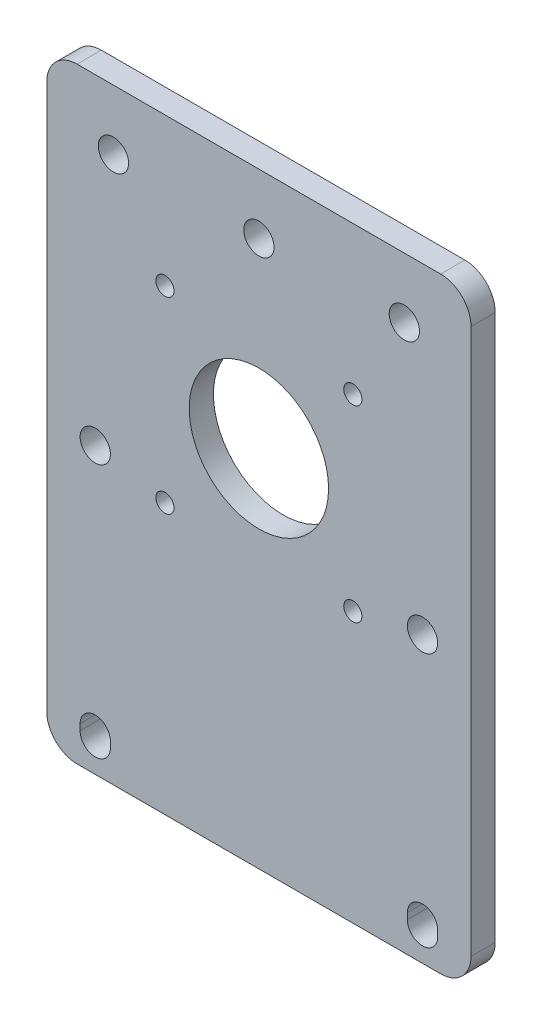
ISO-10303-21;
HEADER;
FILE_DESCRIPTION(('STEP AP214'),'2;1');
FILE_NAME('part.step','',(''),(''),'','','');
FILE_SCHEMA(('AUTOMOTIVE_DESIGN { 1 0 10303 214 1 1 1 1 }'));
ENDSEC;
DATA;
#1=APPLICATION_CONTEXT('core data for automotive mechanical design processes');
#2=APPLICATION_PROTOCOL_DEFINITION('international standard','automotive_design',2000,#1);
#3=PRODUCT_CONTEXT('',#1,'mechanical');
#4=PRODUCT('Part','Part','',(#3));
#5=PRODUCT_RELATED_PRODUCT_CATEGORY('part','',(#4));
#6=PRODUCT_DEFINITION_FORMATION('','',#4);
#7=PRODUCT_DEFINITION_CONTEXT('part definition',#1,'design');
#8=PRODUCT_DEFINITION('design','',#6,#7);
#9=PRODUCT_DEFINITION_SHAPE('','',#8);
#10=(LENGTH_UNIT() NAMED_UNIT(*) SI_UNIT(.MILLI.,.METRE.));
#11=(NAMED_UNIT(*) PLANE_ANGLE_UNIT() SI_UNIT($,.RADIAN.));
#12=(NAMED_UNIT(*) SI_UNIT($,.STERADIAN.) SOLID_ANGLE_UNIT());
#13=UNCERTAINTY_MEASURE_WITH_UNIT(LENGTH_MEASURE(1.E-05),#10,'distance_accuracy_value','');
#14=(GEOMETRIC_REPRESENTATION_CONTEXT(3) GLOBAL_UNCERTAINTY_ASSIGNED_CONTEXT((#13)) GLOBAL_UNIT_ASSIGNED_CONTEXT((#10,
#11,#12)) REPRESENTATION_CONTEXT('',''));
#15=CARTESIAN_POINT('',(0.,0.,0.));
#16=DIRECTION('',(0.,0.,1.));
#17=DIRECTION('',(1.,0.,0.));
#18=AXIS2_PLACEMENT_3D('',#15,#16,#17);
#19=CARTESIAN_POINT('',(0.,0.,4.));
#20=DIRECTION('',(0.,0.,1.));
#21=DIRECTION('',(1.,0.,0.));
#22=AXIS2_PLACEMENT_3D('',#19,#20,#21);
#23=PLANE('',#22);
#24=CARTESIAN_POINT('',(24.,40.076696830622,4.));
#25=DIRECTION('',(0.,0.,1.));
#26=DIRECTION('',(1.,0.,0.));
#27=AXIS2_PLACEMENT_3D('',#24,#25,#26);
#28=CIRCLE('',#27,2.5);
#29=CARTESIAN_POINT('',(26.5,40.076696830622,4.));
#30=VERTEX_POINT('',#29);
#31=EDGE_CURVE('E599',#30,#30,#28,.T.);
#32=ORIENTED_EDGE('',*,*,#31,.F.);
#33=EDGE_LOOP('',(#32));
#34=FACE_BOUND('',#33,.T.);
#35=CARTESIAN_POINT('',(-24.,40.076696830622,4.));
#36=DIRECTION('',(0.,0.,1.));
#37=DIRECTION('',(-1.,0.,0.));
#38=AXIS2_PLACEMENT_3D('',#35,#36,#37);
#39=CIRCLE('',#38,2.5);
#40=CARTESIAN_POINT('',(-26.5,40.076696830622,4.));
#41=VERTEX_POINT('',#40);
#42=EDGE_CURVE('E609',#41,#41,#39,.T.);
#43=ORIENTED_EDGE('',*,*,#42,.F.);
#44=EDGE_LOOP('',(#43));
#45=FACE_BOUND('',#44,.T.);
#46=CARTESIAN_POINT('',(0.,40.076696830622,4.));
#47=DIRECTION('',(0.,0.,1.));
#48=DIRECTION('',(1.,0.,0.));
#49=AXIS2_PLACEMENT_3D('',#46,#47,#48);
#50=CIRCLE('',#49,2.5);
#51=CARTESIAN_POINT('',(2.5,40.076696830622,4.));
#52=VERTEX_POINT('',#51);
#53=EDGE_CURVE('E616',#52,#52,#50,.T.);
#54=ORIENTED_EDGE('',*,*,#53,.F.);
#55=EDGE_LOOP('',(#54));
#56=FACE_BOUND('',#55,.T.);
#57=CARTESIAN_POINT('',(-15.5,-5.42330316937797,4.));
#58=DIRECTION('',(0.,0.,1.));
#59=DIRECTION('',(-1.,0.,0.));
#60=AXIS2_PLACEMENT_3D('',#57,#58,#59);
#61=CIRCLE('',#60,1.5);
#62=CARTESIAN_POINT('',(-17.,-5.42330316937797,4.));
#63=VERTEX_POINT('',#62);
#64=EDGE_CURVE('E622',#63,#63,#61,.T.);
#65=ORIENTED_EDGE('',*,*,#64,.F.);
#66=EDGE_LOOP('',(#65));
#67=FACE_BOUND('',#66,.T.);
#68=CARTESIAN_POINT('',(15.5,-5.42330316937798,4.));
#69=DIRECTION('',(0.,0.,1.));
#70=DIRECTION('',(1.,0.,0.));
#71=AXIS2_PLACEMENT_3D('',#68,#69,#70);
#72=CIRCLE('',#71,1.5);
#73=CARTESIAN_POINT('',(17.,-5.42330316937798,4.));
#74=VERTEX_POINT('',#73);
#75=EDGE_CURVE('E629',#74,#74,#72,.T.);
#76=ORIENTED_EDGE('',*,*,#75,.F.);
#77=EDGE_LOOP('',(#76));
#78=FACE_BOUND('',#77,.T.);
#79=CARTESIAN_POINT('',(15.5,25.576696830622,4.));
#80=DIRECTION('',(0.,0.,1.));
#81=DIRECTION('',(-1.,0.,0.));
#82=AXIS2_PLACEMENT_3D('',#79,#80,#81);
#83=CIRCLE('',#82,1.5);
#84=CARTESIAN_POINT('',(14.,25.576696830622,4.));
#85=VERTEX_POINT('',#84);
#86=EDGE_CURVE('E636',#85,#85,#83,.T.);
#87=ORIENTED_EDGE('',*,*,#86,.F.);
#88=EDGE_LOOP('',(#87));
#89=FACE_BOUND('',#88,.T.);
#90=CARTESIAN_POINT('',(-15.5,25.576696830622,4.));
#91=DIRECTION('',(0.,0.,1.));
#92=DIRECTION('',(1.,0.,0.));
#93=AXIS2_PLACEMENT_3D('',#90,#91,#92);
#94=CIRCLE('',#93,1.5);
#95=CARTESIAN_POINT('',(-14.,25.576696830622,4.));
#96=VERTEX_POINT('',#95);
#97=EDGE_CURVE('E643',#96,#96,#94,.T.);
#98=ORIENTED_EDGE('',*,*,#97,.F.);
#99=EDGE_LOOP('',(#98));
#100=FACE_BOUND('',#99,.T.);
#101=CARTESIAN_POINT('',(0.,10.076696830622,4.));
#102=DIRECTION('',(0.,0.,1.));
#103=DIRECTION('',(1.,0.,0.));
#104=AXIS2_PLACEMENT_3D('',#101,#102,#103);
#105=CIRCLE('',#104,11.5);
#106=CARTESIAN_POINT('',(11.5,10.076696830622,4.));
#107=VERTEX_POINT('',#106);
#108=EDGE_CURVE('E249',#107,#107,#105,.T.);
#109=ORIENTED_EDGE('',*,*,#108,.F.);
#110=EDGE_LOOP('',(#109));
#111=FACE_BOUND('',#110,.T.);
#112=DIRECTION('',(0.,-1.,0.));
#113=VECTOR('',#112,1.);
#114=CARTESIAN_POINT('',(24.5,-44.,4.));
#115=LINE('',#114,#113);
#116=CARTESIAN_POINT('',(24.5,-44.,4.));
#117=VERTEX_POINT('',#116);
#118=CARTESIAN_POINT('',(24.5,-45.,4.));
#119=VERTEX_POINT('',#118);
#120=EDGE_CURVE('E172',#117,#119,#115,.T.);
#121=ORIENTED_EDGE('',*,*,#120,.F.);
#122=CARTESIAN_POINT('',(27.,-44.,4.));
#123=DIRECTION('',(0.,0.,1.));
#124=DIRECTION('',(-1.,0.,0.));
#125=AXIS2_PLACEMENT_3D('',#122,#123,#124);
#126=CIRCLE('',#125,2.5);
#127=CARTESIAN_POINT('',(29.5,-44.,4.));
#128=VERTEX_POINT('',#127);
#129=EDGE_CURVE('E162',#128,#117,#126,.T.);
#130=ORIENTED_EDGE('',*,*,#129,.F.);
#131=DIRECTION('',(0.,1.,0.));
#132=VECTOR('',#131,1.);
#133=CARTESIAN_POINT('',(29.5,-44.,4.));
#134=LINE('',#133,#132);
#135=CARTESIAN_POINT('',(29.5,-45.,4.));
#136=VERTEX_POINT('',#135);
#137=EDGE_CURVE('E189',#136,#128,#134,.T.);
#138=ORIENTED_EDGE('',*,*,#137,.F.);
#139=CARTESIAN_POINT('',(27.,-45.,4.));
#140=DIRECTION('',(0.,0.,1.));
#141=DIRECTION('',(-1.,0.,0.));
#142=AXIS2_PLACEMENT_3D('',#139,#140,#141);
#143=CIRCLE('',#142,2.5);
#144=EDGE_CURVE('E186',#119,#136,#143,.T.);
#145=ORIENTED_EDGE('',*,*,#144,.F.);
#146=EDGE_LOOP('',(#121,#130,#138,#145));
#147=FACE_BOUND('',#146,.T.);
#148=DIRECTION('',(0.,-1.,0.));
#149=VECTOR('',#148,1.);
#150=CARTESIAN_POINT('',(-29.5,-44.,4.));
#151=LINE('',#150,#149);
#152=CARTESIAN_POINT('',(-29.5,-44.,4.));
#153=VERTEX_POINT('',#152);
#154=CARTESIAN_POINT('',(-29.5,-45.,4.));
#155=VERTEX_POINT('',#154);
#156=EDGE_CURVE('E217',#153,#155,#151,.T.);
#157=ORIENTED_EDGE('',*,*,#156,.F.);
#158=CARTESIAN_POINT('',(-27.,-44.,4.));
#159=DIRECTION('',(0.,0.,1.));
#160=DIRECTION('',(1.,0.,0.));
#161=AXIS2_PLACEMENT_3D('',#158,#159,#160);
#162=CIRCLE('',#161,2.5);
#163=CARTESIAN_POINT('',(-24.5,-44.,4.));
#164=VERTEX_POINT('',#163);
#165=EDGE_CURVE('E795',#164,#153,#162,.T.);
#166=ORIENTED_EDGE('',*,*,#165,.F.);
#167=DIRECTION('',(0.,1.,0.));
#168=VECTOR('',#167,1.);
#169=CARTESIAN_POINT('',(-24.5,-44.,4.));
#170=LINE('',#169,#168);
#171=CARTESIAN_POINT('',(-24.5,-45.,4.));
#172=VERTEX_POINT('',#171);
#173=EDGE_CURVE('E216',#172,#164,#170,.T.);
#174=ORIENTED_EDGE('',*,*,#173,.F.);
#175=CARTESIAN_POINT('',(-27.,-45.,4.));
#176=DIRECTION('',(0.,0.,1.));
#177=DIRECTION('',(1.,0.,0.));
#178=AXIS2_PLACEMENT_3D('',#175,#176,#177);
#179=CIRCLE('',#178,2.5);
#180=EDGE_CURVE('E210',#155,#172,#179,.T.);
#181=ORIENTED_EDGE('',*,*,#180,.F.);
#182=EDGE_LOOP('',(#157,#166,#174,#181));
#183=FACE_BOUND('',#182,.T.);
#184=CARTESIAN_POINT('',(-27.,-3.,4.));
#185=DIRECTION('',(0.,0.,1.));
#186=DIRECTION('',(1.,0.,0.));
#187=AXIS2_PLACEMENT_3D('',#184,#185,#186);
#188=CIRCLE('',#187,2.5);
#189=CARTESIAN_POINT('',(-24.5,-3.,4.));
#190=VERTEX_POINT('',#189);
#191=EDGE_CURVE('E227',#190,#190,#188,.T.);
#192=ORIENTED_EDGE('',*,*,#191,.F.);
#193=EDGE_LOOP('',(#192));
#194=FACE_BOUND('',#193,.T.);
#195=DIRECTION('',(0.,-1.,0.));
#196=VECTOR('',#195,1.);
#197=CARTESIAN_POINT('',(-35.,50.,4.));
#198=LINE('',#197,#196);
#199=CARTESIAN_POINT('',(-35.,45.,4.));
#200=VERTEX_POINT('',#199);
#201=CARTESIAN_POINT('',(-35.,-45.,4.));
#202=VERTEX_POINT('',#201);
#203=EDGE_CURVE('E257',#200,#202,#198,.T.);
#204=ORIENTED_EDGE('',*,*,#203,.T.);
#205=CARTESIAN_POINT('',(-30.,-45.,4.));
#206=DIRECTION('',(0.,0.,1.));
#207=DIRECTION('',(1.,0.,0.));
#208=AXIS2_PLACEMENT_3D('',#205,#206,#207);
#209=CIRCLE('',#208,5.);
#210=CARTESIAN_POINT('',(-30.,-50.,4.));
#211=VERTEX_POINT('',#210);
#212=EDGE_CURVE('E303',#202,#211,#209,.T.);
#213=ORIENTED_EDGE('',*,*,#212,.T.);
#214=DIRECTION('',(1.,0.,0.));
#215=VECTOR('',#214,1.);
#216=CARTESIAN_POINT('',(-35.,-50.,4.));
#217=LINE('',#216,#215);
#218=CARTESIAN_POINT('',(30.,-50.,4.));
#219=VERTEX_POINT('',#218);
#220=EDGE_CURVE('E263',#211,#219,#217,.T.);
#221=ORIENTED_EDGE('',*,*,#220,.T.);
#222=CARTESIAN_POINT('',(30.,-45.,4.));
#223=DIRECTION('',(0.,0.,1.));
#224=DIRECTION('',(1.,0.,0.));
#225=AXIS2_PLACEMENT_3D('',#222,#223,#224);
#226=CIRCLE('',#225,5.);
#227=CARTESIAN_POINT('',(35.,-45.,4.));
#228=VERTEX_POINT('',#227);
#229=EDGE_CURVE('E301',#219,#228,#226,.T.);
#230=ORIENTED_EDGE('',*,*,#229,.T.);
#231=DIRECTION('',(0.,1.,0.));
#232=VECTOR('',#231,1.);
#233=CARTESIAN_POINT('',(35.,50.,4.));
#234=LINE('',#233,#232);
#235=CARTESIAN_POINT('',(35.,45.,4.));
#236=VERTEX_POINT('',#235);
#237=EDGE_CURVE('E280',#228,#236,#234,.T.);
#238=ORIENTED_EDGE('',*,*,#237,.T.);
#239=CARTESIAN_POINT('',(30.,45.,4.));
#240=DIRECTION('',(0.,0.,1.));
#241=DIRECTION('',(1.,0.,0.));
#242=AXIS2_PLACEMENT_3D('',#239,#240,#241);
#243=CIRCLE('',#242,5.);
#244=CARTESIAN_POINT('',(30.,50.,4.));
#245=VERTEX_POINT('',#244);
#246=EDGE_CURVE('E68',#236,#245,#243,.T.);
#247=ORIENTED_EDGE('',*,*,#246,.T.);
#248=DIRECTION('',(-1.,0.,0.));
#249=VECTOR('',#248,1.);
#250=CARTESIAN_POINT('',(-35.,50.,4.));
#251=LINE('',#250,#249);
#252=CARTESIAN_POINT('',(-30.,50.,4.));
#253=VERTEX_POINT('',#252);
#254=EDGE_CURVE('E264',#245,#253,#251,.T.);
#255=ORIENTED_EDGE('',*,*,#254,.T.);
#256=CARTESIAN_POINT('',(-30.,45.,4.));
#257=DIRECTION('',(0.,0.,1.));
#258=DIRECTION('',(1.,0.,0.));
#259=AXIS2_PLACEMENT_3D('',#256,#257,#258);
#260=CIRCLE('',#259,5.);
#261=EDGE_CURVE('E298',#253,#200,#260,.T.);
#262=ORIENTED_EDGE('',*,*,#261,.T.);
#263=EDGE_LOOP('',(#204,#213,#221,#230,#238,#247,#255,#262));
#264=FACE_BOUND('',#263,.T.);
#265=CARTESIAN_POINT('',(27.,-3.,4.));
#266=DIRECTION('',(0.,0.,1.));
#267=DIRECTION('',(-1.,0.,0.));
#268=AXIS2_PLACEMENT_3D('',#265,#266,#267);
#269=CIRCLE('',#268,2.5);
#270=CARTESIAN_POINT('',(24.5,-3.,4.));
#271=VERTEX_POINT('',#270);
#272=EDGE_CURVE('E243',#271,#271,#269,.T.);
#273=ORIENTED_EDGE('',*,*,#272,.F.);
#274=EDGE_LOOP('',(#273));
#275=FACE_BOUND('',#274,.T.);
#276=ADVANCED_FACE('F47',(#34,#45,#56,#67,#78,#89,#100,#111,#147,#183,#194,#264,#275),#23,.T.);
#277=CARTESIAN_POINT('',(0.,0.,0.));
#278=DIRECTION('',(0.,0.,1.));
#279=DIRECTION('',(1.,0.,0.));
#280=AXIS2_PLACEMENT_3D('',#277,#278,#279);
#281=PLANE('',#280);
#282=CARTESIAN_POINT('',(24.,40.076696830622,0.));
#283=DIRECTION('',(0.,0.,1.));
#284=DIRECTION('',(1.,0.,0.));
#285=AXIS2_PLACEMENT_3D('',#282,#283,#284);
#286=CIRCLE('',#285,2.5);
#287=CARTESIAN_POINT('',(26.5,40.076696830622,0.));
#288=VERTEX_POINT('',#287);
#289=EDGE_CURVE('E604',#288,#288,#286,.T.);
#290=ORIENTED_EDGE('',*,*,#289,.T.);
#291=EDGE_LOOP('',(#290));
#292=FACE_BOUND('',#291,.T.);
#293=CARTESIAN_POINT('',(-24.,40.076696830622,0.));
#294=DIRECTION('',(0.,0.,1.));
#295=DIRECTION('',(-1.,0.,0.));
#296=AXIS2_PLACEMENT_3D('',#293,#294,#295);
#297=CIRCLE('',#296,2.5);
#298=CARTESIAN_POINT('',(-26.5,40.076696830622,0.));
#299=VERTEX_POINT('',#298);
#300=EDGE_CURVE('E605',#299,#299,#297,.T.);
#301=ORIENTED_EDGE('',*,*,#300,.T.);
#302=EDGE_LOOP('',(#301));
#303=FACE_BOUND('',#302,.T.);
#304=CARTESIAN_POINT('',(0.,40.076696830622,0.));
#305=DIRECTION('',(0.,0.,1.));
#306=DIRECTION('',(1.,0.,0.));
#307=AXIS2_PLACEMENT_3D('',#304,#305,#306);
#308=CIRCLE('',#307,2.5);
#309=CARTESIAN_POINT('',(2.5,40.076696830622,0.));
#310=VERTEX_POINT('',#309);
#311=EDGE_CURVE('E613',#310,#310,#308,.T.);
#312=ORIENTED_EDGE('',*,*,#311,.T.);
#313=EDGE_LOOP('',(#312));
#314=FACE_BOUND('',#313,.T.);
#315=CARTESIAN_POINT('',(-15.5,-5.42330316937797,0.));
#316=DIRECTION('',(0.,0.,1.));
#317=DIRECTION('',(-1.,0.,0.));
#318=AXIS2_PLACEMENT_3D('',#315,#316,#317);
#319=CIRCLE('',#318,1.5);
#320=CARTESIAN_POINT('',(-17.,-5.42330316937797,0.));
#321=VERTEX_POINT('',#320);
#322=EDGE_CURVE('E626',#321,#321,#319,.T.);
#323=ORIENTED_EDGE('',*,*,#322,.T.);
#324=EDGE_LOOP('',(#323));
#325=FACE_BOUND('',#324,.T.);
#326=CARTESIAN_POINT('',(15.5,-5.42330316937798,0.));
#327=DIRECTION('',(0.,0.,1.));
#328=DIRECTION('',(1.,0.,0.));
#329=AXIS2_PLACEMENT_3D('',#326,#327,#328);
#330=CIRCLE('',#329,1.5);
#331=CARTESIAN_POINT('',(17.,-5.42330316937798,0.));
#332=VERTEX_POINT('',#331);
#333=EDGE_CURVE('E633',#332,#332,#330,.T.);
#334=ORIENTED_EDGE('',*,*,#333,.T.);
#335=EDGE_LOOP('',(#334));
#336=FACE_BOUND('',#335,.T.);
#337=CARTESIAN_POINT('',(15.5,25.576696830622,0.));
#338=DIRECTION('',(0.,0.,1.));
#339=DIRECTION('',(-1.,0.,0.));
#340=AXIS2_PLACEMENT_3D('',#337,#338,#339);
#341=CIRCLE('',#340,1.5);
#342=CARTESIAN_POINT('',(14.,25.576696830622,0.));
#343=VERTEX_POINT('',#342);
#344=EDGE_CURVE('E640',#343,#343,#341,.T.);
#345=ORIENTED_EDGE('',*,*,#344,.T.);
#346=EDGE_LOOP('',(#345));
#347=FACE_BOUND('',#346,.T.);
#348=CARTESIAN_POINT('',(-15.5,25.576696830622,0.));
#349=DIRECTION('',(0.,0.,1.));
#350=DIRECTION('',(1.,0.,0.));
#351=AXIS2_PLACEMENT_3D('',#348,#349,#350);
#352=CIRCLE('',#351,1.5);
#353=CARTESIAN_POINT('',(-14.,25.576696830622,0.));
#354=VERTEX_POINT('',#353);
#355=EDGE_CURVE('E647',#354,#354,#352,.T.);
#356=ORIENTED_EDGE('',*,*,#355,.T.);
#357=EDGE_LOOP('',(#356));
#358=FACE_BOUND('',#357,.T.);
#359=CARTESIAN_POINT('',(0.,10.076696830622,0.));
#360=DIRECTION('',(0.,0.,1.));
#361=DIRECTION('',(1.,0.,0.));
#362=AXIS2_PLACEMENT_3D('',#359,#360,#361);
#363=CIRCLE('',#362,11.5);
#364=CARTESIAN_POINT('',(11.5,10.076696830622,0.));
#365=VERTEX_POINT('',#364);
#366=EDGE_CURVE('E652',#365,#365,#363,.T.);
#367=ORIENTED_EDGE('',*,*,#366,.T.);
#368=EDGE_LOOP('',(#367));
#369=FACE_BOUND('',#368,.T.);
#370=CARTESIAN_POINT('',(-27.,-44.,0.));
#371=DIRECTION('',(0.,0.,1.));
#372=DIRECTION('',(1.,0.,0.));
#373=AXIS2_PLACEMENT_3D('',#370,#371,#372);
#374=CIRCLE('',#373,2.5);
#375=CARTESIAN_POINT('',(-24.5,-44.,0.));
#376=VERTEX_POINT('',#375);
#377=CARTESIAN_POINT('',(-29.5,-44.,0.));
#378=VERTEX_POINT('',#377);
#379=EDGE_CURVE('E180',#376,#378,#374,.T.);
#380=ORIENTED_EDGE('',*,*,#379,.T.);
#381=DIRECTION('',(0.,-1.,0.));
#382=VECTOR('',#381,1.);
#383=CARTESIAN_POINT('',(-29.5,-44.,0.));
#384=LINE('',#383,#382);
#385=CARTESIAN_POINT('',(-29.5,-45.,0.));
#386=VERTEX_POINT('',#385);
#387=EDGE_CURVE('E784',#378,#386,#384,.T.);
#388=ORIENTED_EDGE('',*,*,#387,.T.);
#389=CARTESIAN_POINT('',(-27.,-45.,0.));
#390=DIRECTION('',(0.,0.,1.));
#391=DIRECTION('',(1.,0.,0.));
#392=AXIS2_PLACEMENT_3D('',#389,#390,#391);
#393=CIRCLE('',#392,2.5);
#394=CARTESIAN_POINT('',(-24.5,-45.,0.));
#395=VERTEX_POINT('',#394);
#396=EDGE_CURVE('E790',#386,#395,#393,.T.);
#397=ORIENTED_EDGE('',*,*,#396,.T.);
#398=DIRECTION('',(0.,1.,0.));
#399=VECTOR('',#398,1.);
#400=CARTESIAN_POINT('',(-24.5,-44.,0.));
#401=LINE('',#400,#399);
#402=EDGE_CURVE('E786',#395,#376,#401,.T.);
#403=ORIENTED_EDGE('',*,*,#402,.T.);
#404=EDGE_LOOP('',(#380,#388,#397,#403));
#405=FACE_BOUND('',#404,.T.);
#406=DIRECTION('',(1.,0.,0.));
#407=VECTOR('',#406,1.);
#408=CARTESIAN_POINT('',(-35.,-50.,0.));
#409=LINE('',#408,#407);
#410=CARTESIAN_POINT('',(-30.,-50.,0.));
#411=VERTEX_POINT('',#410);
#412=CARTESIAN_POINT('',(30.,-50.,0.));
#413=VERTEX_POINT('',#412);
#414=EDGE_CURVE('E277',#411,#413,#409,.T.);
#415=ORIENTED_EDGE('',*,*,#414,.F.);
#416=CARTESIAN_POINT('',(-30.,-45.,0.));
#417=DIRECTION('',(0.,0.,1.));
#418=DIRECTION('',(1.,0.,0.));
#419=AXIS2_PLACEMENT_3D('',#416,#417,#418);
#420=CIRCLE('',#419,5.);
#421=CARTESIAN_POINT('',(-35.,-45.,0.));
#422=VERTEX_POINT('',#421);
#423=EDGE_CURVE('E291',#411,#422,#420,.F.);
#424=ORIENTED_EDGE('',*,*,#423,.T.);
#425=DIRECTION('',(0.,-1.,0.));
#426=VECTOR('',#425,1.);
#427=CARTESIAN_POINT('',(-35.,50.,0.));
#428=LINE('',#427,#426);
#429=CARTESIAN_POINT('',(-35.,45.,0.));
#430=VERTEX_POINT('',#429);
#431=EDGE_CURVE('E274',#430,#422,#428,.T.);
#432=ORIENTED_EDGE('',*,*,#431,.F.);
#433=CARTESIAN_POINT('',(-30.,45.,0.));
#434=DIRECTION('',(0.,0.,1.));
#435=DIRECTION('',(1.,0.,0.));
#436=AXIS2_PLACEMENT_3D('',#433,#434,#435);
#437=CIRCLE('',#436,5.);
#438=CARTESIAN_POINT('',(-30.,50.,0.));
#439=VERTEX_POINT('',#438);
#440=EDGE_CURVE('E285',#430,#439,#437,.F.);
#441=ORIENTED_EDGE('',*,*,#440,.T.);
#442=DIRECTION('',(-1.,0.,0.));
#443=VECTOR('',#442,1.);
#444=CARTESIAN_POINT('',(-35.,50.,0.));
#445=LINE('',#444,#443);
#446=CARTESIAN_POINT('',(30.,50.,0.));
#447=VERTEX_POINT('',#446);
#448=EDGE_CURVE('E272',#447,#439,#445,.T.);
#449=ORIENTED_EDGE('',*,*,#448,.F.);
#450=CARTESIAN_POINT('',(30.,45.,0.));
#451=DIRECTION('',(0.,0.,1.));
#452=DIRECTION('',(1.,0.,0.));
#453=AXIS2_PLACEMENT_3D('',#450,#451,#452);
#454=CIRCLE('',#453,5.);
#455=CARTESIAN_POINT('',(35.,45.,0.));
#456=VERTEX_POINT('',#455);
#457=EDGE_CURVE('E287',#447,#456,#454,.F.);
#458=ORIENTED_EDGE('',*,*,#457,.T.);
#459=DIRECTION('',(0.,1.,0.));
#460=VECTOR('',#459,1.);
#461=CARTESIAN_POINT('',(35.,50.,0.));
#462=LINE('',#461,#460);
#463=CARTESIAN_POINT('',(35.,-45.,0.));
#464=VERTEX_POINT('',#463);
#465=EDGE_CURVE('E233',#464,#456,#462,.T.);
#466=ORIENTED_EDGE('',*,*,#465,.F.);
#467=CARTESIAN_POINT('',(30.,-45.,0.));
#468=DIRECTION('',(0.,0.,1.));
#469=DIRECTION('',(1.,0.,0.));
#470=AXIS2_PLACEMENT_3D('',#467,#468,#469);
#471=CIRCLE('',#470,5.);
#472=EDGE_CURVE('E289',#464,#413,#471,.F.);
#473=ORIENTED_EDGE('',*,*,#472,.T.);
#474=EDGE_LOOP('',(#415,#424,#432,#441,#449,#458,#466,#473));
#475=FACE_BOUND('',#474,.T.);
#476=CARTESIAN_POINT('',(-27.,-3.,0.));
#477=DIRECTION('',(0.,0.,1.));
#478=DIRECTION('',(1.,0.,0.));
#479=AXIS2_PLACEMENT_3D('',#476,#477,#478);
#480=CIRCLE('',#479,2.5);
#481=CARTESIAN_POINT('',(-24.5,-3.,0.));
#482=VERTEX_POINT('',#481);
#483=EDGE_CURVE('E234',#482,#482,#480,.T.);
#484=ORIENTED_EDGE('',*,*,#483,.T.);
#485=EDGE_LOOP('',(#484));
#486=FACE_BOUND('',#485,.T.);
#487=CARTESIAN_POINT('',(27.,-44.,0.));
#488=DIRECTION('',(0.,0.,1.));
#489=DIRECTION('',(-1.,0.,0.));
#490=AXIS2_PLACEMENT_3D('',#487,#488,#489);
#491=CIRCLE('',#490,2.5);
#492=CARTESIAN_POINT('',(29.5,-44.,0.));
#493=VERTEX_POINT('',#492);
#494=CARTESIAN_POINT('',(24.5,-44.,0.));
#495=VERTEX_POINT('',#494);
#496=EDGE_CURVE('E247',#493,#495,#491,.T.);
#497=ORIENTED_EDGE('',*,*,#496,.T.);
#498=DIRECTION('',(0.,-1.,0.));
#499=VECTOR('',#498,1.);
#500=CARTESIAN_POINT('',(24.5,-44.,0.));
#501=LINE('',#500,#499);
#502=CARTESIAN_POINT('',(24.5,-45.,0.));
#503=VERTEX_POINT('',#502);
#504=EDGE_CURVE('E179',#495,#503,#501,.T.);
#505=ORIENTED_EDGE('',*,*,#504,.T.);
#506=CARTESIAN_POINT('',(27.,-45.,0.));
#507=DIRECTION('',(0.,0.,1.));
#508=DIRECTION('',(-1.,0.,0.));
#509=AXIS2_PLACEMENT_3D('',#506,#507,#508);
#510=CIRCLE('',#509,2.5);
#511=CARTESIAN_POINT('',(29.5,-45.,0.));
#512=VERTEX_POINT('',#511);
#513=EDGE_CURVE('E814',#503,#512,#510,.T.);
#514=ORIENTED_EDGE('',*,*,#513,.T.);
#515=DIRECTION('',(0.,1.,0.));
#516=VECTOR('',#515,1.);
#517=CARTESIAN_POINT('',(29.5,-44.,0.));
#518=LINE('',#517,#516);
#519=EDGE_CURVE('E173',#512,#493,#518,.T.);
#520=ORIENTED_EDGE('',*,*,#519,.T.);
#521=EDGE_LOOP('',(#497,#505,#514,#520));
#522=FACE_BOUND('',#521,.T.);
#523=CARTESIAN_POINT('',(27.,-3.,0.));
#524=DIRECTION('',(0.,0.,1.));
#525=DIRECTION('',(-1.,0.,0.));
#526=AXIS2_PLACEMENT_3D('',#523,#524,#525);
#527=CIRCLE('',#526,2.5);
#528=CARTESIAN_POINT('',(24.5,-3.,0.));
#529=VERTEX_POINT('',#528);
#530=EDGE_CURVE('E248',#529,#529,#527,.T.);
#531=ORIENTED_EDGE('',*,*,#530,.T.);
#532=EDGE_LOOP('',(#531));
#533=FACE_BOUND('',#532,.T.);
#534=ADVANCED_FACE('F319',(#292,#303,#314,#325,#336,#347,#358,#369,#405,#475,#486,#522,#533),
#281,.F.);
#535=CARTESIAN_POINT('',(35.,50.,4.));
#536=DIRECTION('',(-1.,0.,0.));
#537=DIRECTION('',(0.,-1.,0.));
#538=AXIS2_PLACEMENT_3D('',#535,#536,#537);
#539=PLANE('',#538);
#540=ORIENTED_EDGE('',*,*,#237,.F.);
#541=DIRECTION('',(0.,0.,-1.));
#542=VECTOR('',#541,1.);
#543=CARTESIAN_POINT('',(35.,-45.,4.));
#544=LINE('',#543,#542);
#545=EDGE_CURVE('E307',#228,#464,#544,.T.);
#546=ORIENTED_EDGE('',*,*,#545,.T.);
#547=ORIENTED_EDGE('',*,*,#465,.T.);
#548=DIRECTION('',(0.,0.,-1.));
#549=VECTOR('',#548,1.);
#550=CARTESIAN_POINT('',(35.,45.,4.));
#551=LINE('',#550,#549);
#552=EDGE_CURVE('E305',#456,#236,#551,.F.);
#553=ORIENTED_EDGE('',*,*,#552,.T.);
#554=EDGE_LOOP('',(#540,#546,#547,#553));
#555=FACE_BOUND('',#554,.T.);
#556=ADVANCED_FACE('F313',(#555),#539,.F.);
#557=CARTESIAN_POINT('',(-35.,50.,4.));
#558=DIRECTION('',(0.,-1.,0.));
#559=DIRECTION('',(0.,0.,-1.));
#560=AXIS2_PLACEMENT_3D('',#557,#558,#559);
#561=PLANE('',#560);
#562=ORIENTED_EDGE('',*,*,#254,.F.);
#563=DIRECTION('',(0.,0.,-1.));
#564=VECTOR('',#563,1.);
#565=CARTESIAN_POINT('',(30.,50.,4.));
#566=LINE('',#565,#564);
#567=EDGE_CURVE('E12',#245,#447,#566,.T.);
#568=ORIENTED_EDGE('',*,*,#567,.T.);
#569=ORIENTED_EDGE('',*,*,#448,.T.);
#570=DIRECTION('',(0.,0.,-1.));
#571=VECTOR('',#570,1.);
#572=CARTESIAN_POINT('',(-30.,50.,4.));
#573=LINE('',#572,#571);
#574=EDGE_CURVE('E55',#439,#253,#573,.F.);
#575=ORIENTED_EDGE('',*,*,#574,.T.);
#576=EDGE_LOOP('',(#562,#568,#569,#575));
#577=FACE_BOUND('',#576,.T.);
#578=ADVANCED_FACE('F325',(#577),#561,.F.);
#579=CARTESIAN_POINT('',(-35.,50.,4.));
#580=DIRECTION('',(1.,0.,0.));
#581=DIRECTION('',(0.,1.,0.));
#582=AXIS2_PLACEMENT_3D('',#579,#580,#581);
#583=PLANE('',#582);
#584=ORIENTED_EDGE('',*,*,#431,.T.);
#585=DIRECTION('',(0.,0.,-1.));
#586=VECTOR('',#585,1.);
#587=CARTESIAN_POINT('',(-35.,-45.,4.));
#588=LINE('',#587,#586);
#589=EDGE_CURVE('E296',#422,#202,#588,.F.);
#590=ORIENTED_EDGE('',*,*,#589,.T.);
#591=ORIENTED_EDGE('',*,*,#203,.F.);
#592=DIRECTION('',(0.,0.,-1.));
#593=VECTOR('',#592,1.);
#594=CARTESIAN_POINT('',(-35.,45.,4.));
#595=LINE('',#594,#593);
#596=EDGE_CURVE('E293',#200,#430,#595,.T.);
#597=ORIENTED_EDGE('',*,*,#596,.T.);
#598=EDGE_LOOP('',(#584,#590,#591,#597));
#599=FACE_BOUND('',#598,.T.);
#600=ADVANCED_FACE('F338',(#599),#583,.F.);
#601=CARTESIAN_POINT('',(-35.,-50.,4.));
#602=DIRECTION('',(0.,1.,0.));
#603=DIRECTION('',(0.,0.,1.));
#604=AXIS2_PLACEMENT_3D('',#601,#602,#603);
#605=PLANE('',#604);
#606=ORIENTED_EDGE('',*,*,#220,.F.);
#607=DIRECTION('',(0.,0.,-1.));
#608=VECTOR('',#607,1.);
#609=CARTESIAN_POINT('',(-30.,-50.,4.));
#610=LINE('',#609,#608);
#611=EDGE_CURVE('E282',#211,#411,#610,.T.);
#612=ORIENTED_EDGE('',*,*,#611,.T.);
#613=ORIENTED_EDGE('',*,*,#414,.T.);
#614=DIRECTION('',(0.,0.,-1.));
#615=VECTOR('',#614,1.);
#616=CARTESIAN_POINT('',(30.,-50.,4.));
#617=LINE('',#616,#615);
#618=EDGE_CURVE('E269',#413,#219,#617,.F.);
#619=ORIENTED_EDGE('',*,*,#618,.T.);
#620=EDGE_LOOP('',(#606,#612,#613,#619));
#621=FACE_BOUND('',#620,.T.);
#622=ADVANCED_FACE('F332',(#621),#605,.F.);
#623=CARTESIAN_POINT('',(-27.,-3.,4.));
#624=DIRECTION('',(0.,0.,-1.));
#625=DIRECTION('',(-1.,0.,0.));
#626=AXIS2_PLACEMENT_3D('',#623,#624,#625);
#627=CYLINDRICAL_SURFACE('',#626,2.5);
#628=ORIENTED_EDGE('',*,*,#191,.T.);
#629=EDGE_LOOP('',(#628));
#630=FACE_BOUND('',#629,.T.);
#631=ORIENTED_EDGE('',*,*,#483,.F.);
#632=EDGE_LOOP('',(#631));
#633=FACE_BOUND('',#632,.T.);
#634=ADVANCED_FACE('F360',(#630,#633),#627,.F.);
#635=CARTESIAN_POINT('',(-27.,-44.,4.));
#636=DIRECTION('',(0.,0.,-1.));
#637=DIRECTION('',(-1.,0.,0.));
#638=AXIS2_PLACEMENT_3D('',#635,#636,#637);
#639=CYLINDRICAL_SURFACE('',#638,2.5);
#640=ORIENTED_EDGE('',*,*,#379,.F.);
#641=DIRECTION('',(0.,0.,-1.));
#642=VECTOR('',#641,1.);
#643=CARTESIAN_POINT('',(-24.5,-44.,4.));
#644=LINE('',#643,#642);
#645=EDGE_CURVE('E796',#164,#376,#644,.T.);
#646=ORIENTED_EDGE('',*,*,#645,.F.);
#647=ORIENTED_EDGE('',*,*,#165,.T.);
#648=DIRECTION('',(0.,0.,-1.));
#649=VECTOR('',#648,1.);
#650=CARTESIAN_POINT('',(-29.5,-44.,4.));
#651=LINE('',#650,#649);
#652=EDGE_CURVE('E235',#153,#378,#651,.T.);
#653=ORIENTED_EDGE('',*,*,#652,.T.);
#654=EDGE_LOOP('',(#640,#646,#647,#653));
#655=FACE_BOUND('',#654,.T.);
#656=ADVANCED_FACE('F547',(#655),#639,.F.);
#657=CARTESIAN_POINT('',(-29.5,-44.,4.));
#658=DIRECTION('',(1.,0.,0.));
#659=DIRECTION('',(0.,1.,0.));
#660=AXIS2_PLACEMENT_3D('',#657,#658,#659);
#661=PLANE('',#660);
#662=ORIENTED_EDGE('',*,*,#387,.F.);
#663=ORIENTED_EDGE('',*,*,#652,.F.);
#664=ORIENTED_EDGE('',*,*,#156,.T.);
#665=DIRECTION('',(0.,0.,-1.));
#666=VECTOR('',#665,1.);
#667=CARTESIAN_POINT('',(-29.5,-45.,4.));
#668=LINE('',#667,#666);
#669=EDGE_CURVE('E799',#155,#386,#668,.T.);
#670=ORIENTED_EDGE('',*,*,#669,.T.);
#671=EDGE_LOOP('',(#662,#663,#664,#670));
#672=FACE_BOUND('',#671,.T.);
#673=ADVANCED_FACE('F537',(#672),#661,.T.);
#674=CARTESIAN_POINT('',(-27.,-45.,4.));
#675=DIRECTION('',(0.,0.,-1.));
#676=DIRECTION('',(-1.,0.,0.));
#677=AXIS2_PLACEMENT_3D('',#674,#675,#676);
#678=CYLINDRICAL_SURFACE('',#677,2.5);
#679=ORIENTED_EDGE('',*,*,#396,.F.);
#680=ORIENTED_EDGE('',*,*,#669,.F.);
#681=ORIENTED_EDGE('',*,*,#180,.T.);
#682=DIRECTION('',(0.,0.,-1.));
#683=VECTOR('',#682,1.);
#684=CARTESIAN_POINT('',(-24.5,-45.,4.));
#685=LINE('',#684,#683);
#686=EDGE_CURVE('E798',#172,#395,#685,.T.);
#687=ORIENTED_EDGE('',*,*,#686,.T.);
#688=EDGE_LOOP('',(#679,#680,#681,#687));
#689=FACE_BOUND('',#688,.T.);
#690=ADVANCED_FACE('F528',(#689),#678,.F.);
#691=CARTESIAN_POINT('',(-24.5,-44.,4.));
#692=DIRECTION('',(-1.,0.,0.));
#693=DIRECTION('',(0.,-1.,0.));
#694=AXIS2_PLACEMENT_3D('',#691,#692,#693);
#695=PLANE('',#694);
#696=ORIENTED_EDGE('',*,*,#402,.F.);
#697=ORIENTED_EDGE('',*,*,#686,.F.);
#698=ORIENTED_EDGE('',*,*,#173,.T.);
#699=ORIENTED_EDGE('',*,*,#645,.T.);
#700=EDGE_LOOP('',(#696,#697,#698,#699));
#701=FACE_BOUND('',#700,.T.);
#702=ADVANCED_FACE('F520',(#701),#695,.T.);
#703=CARTESIAN_POINT('',(27.,-44.,4.));
#704=DIRECTION('',(0.,0.,-1.));
#705=DIRECTION('',(-1.,0.,0.));
#706=AXIS2_PLACEMENT_3D('',#703,#704,#705);
#707=CYLINDRICAL_SURFACE('',#706,2.5);
#708=ORIENTED_EDGE('',*,*,#496,.F.);
#709=DIRECTION('',(0.,0.,-1.));
#710=VECTOR('',#709,1.);
#711=CARTESIAN_POINT('',(29.5,-44.,4.));
#712=LINE('',#711,#710);
#713=EDGE_CURVE('E168',#128,#493,#712,.T.);
#714=ORIENTED_EDGE('',*,*,#713,.F.);
#715=ORIENTED_EDGE('',*,*,#129,.T.);
#716=DIRECTION('',(0.,0.,-1.));
#717=VECTOR('',#716,1.);
#718=CARTESIAN_POINT('',(24.5,-44.,4.));
#719=LINE('',#718,#717);
#720=EDGE_CURVE('E165',#117,#495,#719,.T.);
#721=ORIENTED_EDGE('',*,*,#720,.T.);
#722=EDGE_LOOP('',(#708,#714,#715,#721));
#723=FACE_BOUND('',#722,.T.);
#724=ADVANCED_FACE('F164',(#723),#707,.F.);
#725=CARTESIAN_POINT('',(24.5,-44.,4.));
#726=DIRECTION('',(1.,0.,0.));
#727=DIRECTION('',(0.,1.,0.));
#728=AXIS2_PLACEMENT_3D('',#725,#726,#727);
#729=PLANE('',#728);
#730=ORIENTED_EDGE('',*,*,#504,.F.);
#731=ORIENTED_EDGE('',*,*,#720,.F.);
#732=ORIENTED_EDGE('',*,*,#120,.T.);
#733=DIRECTION('',(0.,0.,-1.));
#734=VECTOR('',#733,1.);
#735=CARTESIAN_POINT('',(24.5,-45.,4.));
#736=LINE('',#735,#734);
#737=EDGE_CURVE('E181',#119,#503,#736,.T.);
#738=ORIENTED_EDGE('',*,*,#737,.T.);
#739=EDGE_LOOP('',(#730,#731,#732,#738));
#740=FACE_BOUND('',#739,.T.);
#741=ADVANCED_FACE('F176',(#740),#729,.T.);
#742=CARTESIAN_POINT('',(27.,-45.,4.));
#743=DIRECTION('',(0.,0.,-1.));
#744=DIRECTION('',(-1.,0.,0.));
#745=AXIS2_PLACEMENT_3D('',#742,#743,#744);
#746=CYLINDRICAL_SURFACE('',#745,2.5);
#747=ORIENTED_EDGE('',*,*,#513,.F.);
#748=ORIENTED_EDGE('',*,*,#737,.F.);
#749=ORIENTED_EDGE('',*,*,#144,.T.);
#750=DIRECTION('',(0.,0.,-1.));
#751=VECTOR('',#750,1.);
#752=CARTESIAN_POINT('',(29.5,-45.,4.));
#753=LINE('',#752,#751);
#754=EDGE_CURVE('E820',#136,#512,#753,.T.);
#755=ORIENTED_EDGE('',*,*,#754,.T.);
#756=EDGE_LOOP('',(#747,#748,#749,#755));
#757=FACE_BOUND('',#756,.T.);
#758=ADVANCED_FACE('F495',(#757),#746,.F.);
#759=CARTESIAN_POINT('',(29.5,-44.,4.));
#760=DIRECTION('',(-1.,0.,0.));
#761=DIRECTION('',(0.,-1.,0.));
#762=AXIS2_PLACEMENT_3D('',#759,#760,#761);
#763=PLANE('',#762);
#764=ORIENTED_EDGE('',*,*,#519,.F.);
#765=ORIENTED_EDGE('',*,*,#754,.F.);
#766=ORIENTED_EDGE('',*,*,#137,.T.);
#767=ORIENTED_EDGE('',*,*,#713,.T.);
#768=EDGE_LOOP('',(#764,#765,#766,#767));
#769=FACE_BOUND('',#768,.T.);
#770=ADVANCED_FACE('F485',(#769),#763,.T.);
#771=CARTESIAN_POINT('',(27.,-3.,4.));
#772=DIRECTION('',(0.,0.,-1.));
#773=DIRECTION('',(-1.,0.,0.));
#774=AXIS2_PLACEMENT_3D('',#771,#772,#773);
#775=CYLINDRICAL_SURFACE('',#774,2.5);
#776=ORIENTED_EDGE('',*,*,#272,.T.);
#777=EDGE_LOOP('',(#776));
#778=FACE_BOUND('',#777,.T.);
#779=ORIENTED_EDGE('',*,*,#530,.F.);
#780=EDGE_LOOP('',(#779));
#781=FACE_BOUND('',#780,.T.);
#782=ADVANCED_FACE('F475',(#778,#781),#775,.F.);
#783=CARTESIAN_POINT('',(0.,10.076696830622,0.));
#784=DIRECTION('',(0.,0.,1.));
#785=DIRECTION('',(1.,0.,0.));
#786=AXIS2_PLACEMENT_3D('',#783,#784,#785);
#787=CYLINDRICAL_SURFACE('',#786,11.5);
#788=ORIENTED_EDGE('',*,*,#366,.F.);
#789=EDGE_LOOP('',(#788));
#790=FACE_BOUND('',#789,.T.);
#791=ORIENTED_EDGE('',*,*,#108,.T.);
#792=EDGE_LOOP('',(#791));
#793=FACE_BOUND('',#792,.T.);
#794=ADVANCED_FACE('F465',(#790,#793),#787,.F.);
#795=CARTESIAN_POINT('',(-15.5,25.576696830622,0.));
#796=DIRECTION('',(0.,0.,1.));
#797=DIRECTION('',(1.,0.,0.));
#798=AXIS2_PLACEMENT_3D('',#795,#796,#797);
#799=CYLINDRICAL_SURFACE('',#798,1.5);
#800=ORIENTED_EDGE('',*,*,#355,.F.);
#801=EDGE_LOOP('',(#800));
#802=FACE_BOUND('',#801,.T.);
#803=ORIENTED_EDGE('',*,*,#97,.T.);
#804=EDGE_LOOP('',(#803));
#805=FACE_BOUND('',#804,.T.);
#806=ADVANCED_FACE('F455',(#802,#805),#799,.F.);
#807=CARTESIAN_POINT('',(15.5,25.576696830622,0.));
#808=DIRECTION('',(0.,0.,1.));
#809=DIRECTION('',(1.,0.,0.));
#810=AXIS2_PLACEMENT_3D('',#807,#808,#809);
#811=CYLINDRICAL_SURFACE('',#810,1.5);
#812=ORIENTED_EDGE('',*,*,#344,.F.);
#813=EDGE_LOOP('',(#812));
#814=FACE_BOUND('',#813,.T.);
#815=ORIENTED_EDGE('',*,*,#86,.T.);
#816=EDGE_LOOP('',(#815));
#817=FACE_BOUND('',#816,.T.);
#818=ADVANCED_FACE('F445',(#814,#817),#811,.F.);
#819=CARTESIAN_POINT('',(15.5,-5.42330316937798,0.));
#820=DIRECTION('',(0.,0.,1.));
#821=DIRECTION('',(1.,0.,0.));
#822=AXIS2_PLACEMENT_3D('',#819,#820,#821);
#823=CYLINDRICAL_SURFACE('',#822,1.5);
#824=ORIENTED_EDGE('',*,*,#333,.F.);
#825=EDGE_LOOP('',(#824));
#826=FACE_BOUND('',#825,.T.);
#827=ORIENTED_EDGE('',*,*,#75,.T.);
#828=EDGE_LOOP('',(#827));
#829=FACE_BOUND('',#828,.T.);
#830=ADVANCED_FACE('F435',(#826,#829),#823,.F.);
#831=CARTESIAN_POINT('',(-15.5,-5.42330316937797,0.));
#832=DIRECTION('',(0.,0.,1.));
#833=DIRECTION('',(1.,0.,0.));
#834=AXIS2_PLACEMENT_3D('',#831,#832,#833);
#835=CYLINDRICAL_SURFACE('',#834,1.5);
#836=ORIENTED_EDGE('',*,*,#322,.F.);
#837=EDGE_LOOP('',(#836));
#838=FACE_BOUND('',#837,.T.);
#839=ORIENTED_EDGE('',*,*,#64,.T.);
#840=EDGE_LOOP('',(#839));
#841=FACE_BOUND('',#840,.T.);
#842=ADVANCED_FACE('F425',(#838,#841),#835,.F.);
#843=CARTESIAN_POINT('',(0.,40.076696830622,0.));
#844=DIRECTION('',(0.,0.,1.));
#845=DIRECTION('',(1.,0.,0.));
#846=AXIS2_PLACEMENT_3D('',#843,#844,#845);
#847=CYLINDRICAL_SURFACE('',#846,2.5);
#848=ORIENTED_EDGE('',*,*,#311,.F.);
#849=EDGE_LOOP('',(#848));
#850=FACE_BOUND('',#849,.T.);
#851=ORIENTED_EDGE('',*,*,#53,.T.);
#852=EDGE_LOOP('',(#851));
#853=FACE_BOUND('',#852,.T.);
#854=ADVANCED_FACE('F415',(#850,#853),#847,.F.);
#855=CARTESIAN_POINT('',(-24.,40.076696830622,0.));
#856=DIRECTION('',(0.,0.,1.));
#857=DIRECTION('',(1.,0.,0.));
#858=AXIS2_PLACEMENT_3D('',#855,#856,#857);
#859=CYLINDRICAL_SURFACE('',#858,2.5);
#860=ORIENTED_EDGE('',*,*,#300,.F.);
#861=EDGE_LOOP('',(#860));
#862=FACE_BOUND('',#861,.T.);
#863=ORIENTED_EDGE('',*,*,#42,.T.);
#864=EDGE_LOOP('',(#863));
#865=FACE_BOUND('',#864,.T.);
#866=ADVANCED_FACE('F404',(#862,#865),#859,.F.);
#867=CARTESIAN_POINT('',(24.,40.076696830622,0.));
#868=DIRECTION('',(0.,0.,1.));
#869=DIRECTION('',(1.,0.,0.));
#870=AXIS2_PLACEMENT_3D('',#867,#868,#869);
#871=CYLINDRICAL_SURFACE('',#870,2.5);
#872=ORIENTED_EDGE('',*,*,#289,.F.);
#873=EDGE_LOOP('',(#872));
#874=FACE_BOUND('',#873,.T.);
#875=ORIENTED_EDGE('',*,*,#31,.T.);
#876=EDGE_LOOP('',(#875));
#877=FACE_BOUND('',#876,.T.);
#878=ADVANCED_FACE('F373',(#874,#877),#871,.F.);
#879=CARTESIAN_POINT('',(-30.,-45.,4.));
#880=DIRECTION('',(0.,0.,-1.));
#881=DIRECTION('',(-1.,0.,0.));
#882=AXIS2_PLACEMENT_3D('',#879,#880,#881);
#883=CYLINDRICAL_SURFACE('',#882,5.);
#884=ORIENTED_EDGE('',*,*,#212,.F.);
#885=ORIENTED_EDGE('',*,*,#589,.F.);
#886=ORIENTED_EDGE('',*,*,#423,.F.);
#887=ORIENTED_EDGE('',*,*,#611,.F.);
#888=EDGE_LOOP('',(#884,#885,#886,#887));
#889=FACE_BOUND('',#888,.T.);
#890=ADVANCED_FACE('F342',(#889),#883,.T.);
#891=CARTESIAN_POINT('',(30.,-45.,4.));
#892=DIRECTION('',(0.,0.,-1.));
#893=DIRECTION('',(-1.,0.,0.));
#894=AXIS2_PLACEMENT_3D('',#891,#892,#893);
#895=CYLINDRICAL_SURFACE('',#894,5.);
#896=ORIENTED_EDGE('',*,*,#229,.F.);
#897=ORIENTED_EDGE('',*,*,#618,.F.);
#898=ORIENTED_EDGE('',*,*,#472,.F.);
#899=ORIENTED_EDGE('',*,*,#545,.F.);
#900=EDGE_LOOP('',(#896,#897,#898,#899));
#901=FACE_BOUND('',#900,.T.);
#902=ADVANCED_FACE('F330',(#901),#895,.T.);
#903=CARTESIAN_POINT('',(30.,45.,4.));
#904=DIRECTION('',(0.,0.,-1.));
#905=DIRECTION('',(-1.,0.,0.));
#906=AXIS2_PLACEMENT_3D('',#903,#904,#905);
#907=CYLINDRICAL_SURFACE('',#906,5.);
#908=ORIENTED_EDGE('',*,*,#246,.F.);
#909=ORIENTED_EDGE('',*,*,#552,.F.);
#910=ORIENTED_EDGE('',*,*,#457,.F.);
#911=ORIENTED_EDGE('',*,*,#567,.F.);
#912=EDGE_LOOP('',(#908,#909,#910,#911));
#913=FACE_BOUND('',#912,.T.);
#914=ADVANCED_FACE('F324',(#913),#907,.T.);
#915=CARTESIAN_POINT('',(-30.,45.,4.));
#916=DIRECTION('',(0.,0.,-1.));
#917=DIRECTION('',(-1.,0.,0.));
#918=AXIS2_PLACEMENT_3D('',#915,#916,#917);
#919=CYLINDRICAL_SURFACE('',#918,5.);
#920=ORIENTED_EDGE('',*,*,#261,.F.);
#921=ORIENTED_EDGE('',*,*,#574,.F.);
#922=ORIENTED_EDGE('',*,*,#440,.F.);
#923=ORIENTED_EDGE('',*,*,#596,.F.);
#924=EDGE_LOOP('',(#920,#921,#922,#923));
#925=FACE_BOUND('',#924,.T.);
#926=ADVANCED_FACE('F49',(#925),#919,.T.);
#927=CLOSED_SHELL('',(#276,#534,#556,#578,#600,#622,#634,#656,#673,#690,#702,#724,#741,#758,
#770,#782,#794,#806,#818,#830,#842,#854,#866,#878,#890,#902,#914,#926));
#928=MANIFOLD_SOLID_BREP('B2',#927);
#929=ADVANCED_BREP_SHAPE_REPRESENTATION('',(#18,#928),#14);
#930=SHAPE_DEFINITION_REPRESENTATION(#9,#929);
ENDSEC;
END-ISO-10303-21;
